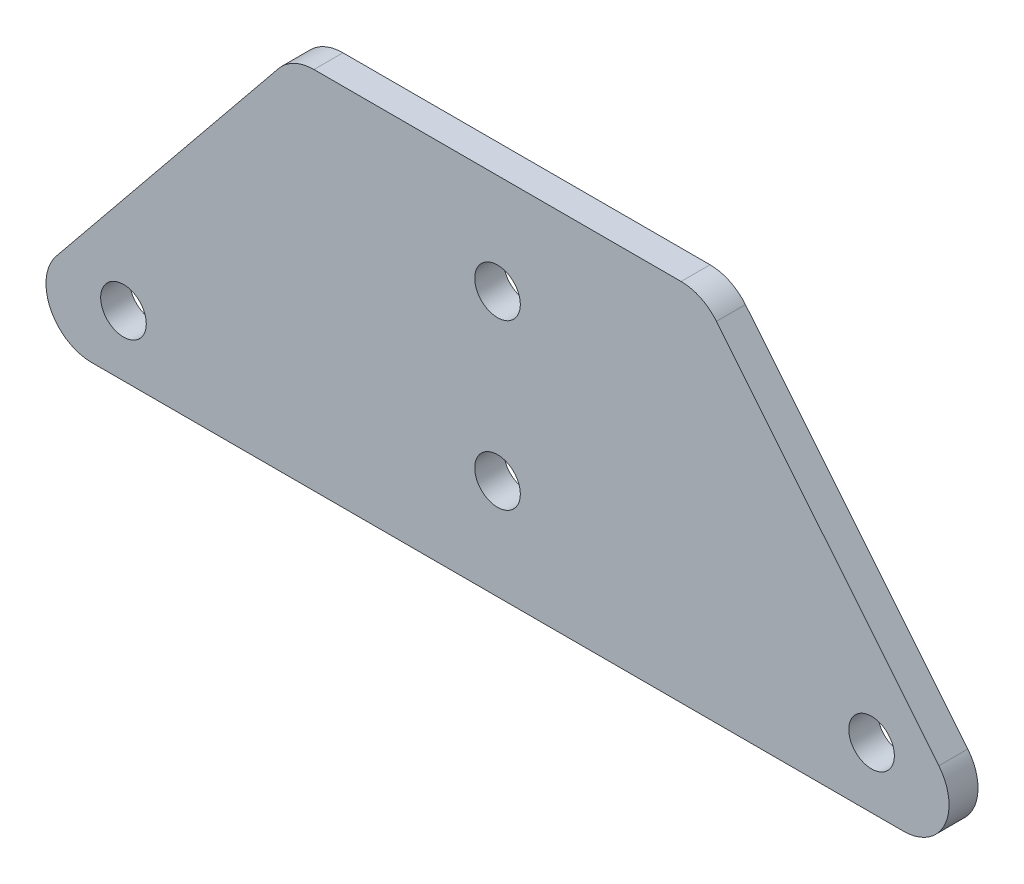
ISO-10303-21;
HEADER;
FILE_DESCRIPTION(('STEP AP214'),'2;1');
FILE_NAME('part.step','',(''),(''),'','','');
FILE_SCHEMA(('AUTOMOTIVE_DESIGN { 1 0 10303 214 1 1 1 1 }'));
ENDSEC;
DATA;
#1=APPLICATION_CONTEXT('core data for automotive mechanical design processes');
#2=APPLICATION_PROTOCOL_DEFINITION('international standard','automotive_design',2000,#1);
#3=PRODUCT_CONTEXT('',#1,'mechanical');
#4=PRODUCT('Part','Part','',(#3));
#5=PRODUCT_RELATED_PRODUCT_CATEGORY('part','',(#4));
#6=PRODUCT_DEFINITION_FORMATION('','',#4);
#7=PRODUCT_DEFINITION_CONTEXT('part definition',#1,'design');
#8=PRODUCT_DEFINITION('design','',#6,#7);
#9=PRODUCT_DEFINITION_SHAPE('','',#8);
#10=(LENGTH_UNIT() NAMED_UNIT(*) SI_UNIT(.MILLI.,.METRE.));
#11=(NAMED_UNIT(*) PLANE_ANGLE_UNIT() SI_UNIT($,.RADIAN.));
#12=(NAMED_UNIT(*) SI_UNIT($,.STERADIAN.) SOLID_ANGLE_UNIT());
#13=UNCERTAINTY_MEASURE_WITH_UNIT(LENGTH_MEASURE(1.E-05),#10,'distance_accuracy_value','');
#14=(GEOMETRIC_REPRESENTATION_CONTEXT(3) GLOBAL_UNCERTAINTY_ASSIGNED_CONTEXT((#13)) GLOBAL_UNIT_ASSIGNED_CONTEXT((#10,
#11,#12)) REPRESENTATION_CONTEXT('',''));
#15=CARTESIAN_POINT('',(0.,0.,0.));
#16=DIRECTION('',(0.,0.,1.));
#17=DIRECTION('',(1.,0.,0.));
#18=AXIS2_PLACEMENT_3D('',#15,#16,#17);
#19=CARTESIAN_POINT('',(44.4951474599724,-18.1529631254723,3.175));
#20=DIRECTION('',(0.,0.,1.));
#21=DIRECTION('',(1.,0.,0.));
#22=AXIS2_PLACEMENT_3D('',#19,#20,#21);
#23=PLANE('',#22);
#24=CARTESIAN_POINT('',(-41.,-16.4893760133951,3.175));
#25=DIRECTION('',(0.,0.,1.));
#26=DIRECTION('',(1.,0.,0.));
#27=AXIS2_PLACEMENT_3D('',#24,#25,#26);
#28=CIRCLE('',#27,2.5);
#29=CARTESIAN_POINT('',(-38.5,-16.4893760133951,3.175));
#30=VERTEX_POINT('',#29);
#31=EDGE_CURVE('E192',#30,#30,#28,.T.);
#32=ORIENTED_EDGE('',*,*,#31,.F.);
#33=EDGE_LOOP('',(#32));
#34=FACE_BOUND('',#33,.T.);
#35=CARTESIAN_POINT('',(0.,-12.1529631254723,3.175));
#36=DIRECTION('',(0.,0.,1.));
#37=DIRECTION('',(1.,0.,0.));
#38=AXIS2_PLACEMENT_3D('',#35,#36,#37);
#39=CIRCLE('',#38,2.5);
#40=CARTESIAN_POINT('',(2.50000000000001,-12.1529631254723,3.175));
#41=VERTEX_POINT('',#40);
#42=EDGE_CURVE('E138',#41,#41,#39,.T.);
#43=ORIENTED_EDGE('',*,*,#42,.F.);
#44=EDGE_LOOP('',(#43));
#45=FACE_BOUND('',#44,.T.);
#46=CARTESIAN_POINT('',(44.4951474599724,-18.1529631254723,3.175));
#47=DIRECTION('',(0.,0.,1.));
#48=DIRECTION('',(1.,0.,0.));
#49=AXIS2_PLACEMENT_3D('',#46,#47,#48);
#50=CIRCLE('',#49,5.00000000000001);
#51=CARTESIAN_POINT('',(44.4951474599724,-23.1529631254723,3.175));
#52=VERTEX_POINT('',#51);
#53=CARTESIAN_POINT('',(48.3757174605537,-15.,3.175));
#54=VERTEX_POINT('',#53);
#55=EDGE_CURVE('E149',#52,#54,#50,.T.);
#56=ORIENTED_EDGE('',*,*,#55,.T.);
#57=DIRECTION('',(-0.630592625094466,0.776114000116265,0.));
#58=VECTOR('',#57,1.);
#59=CARTESIAN_POINT('',(48.3757174605537,-15.,3.175));
#60=LINE('',#59,#58);
#61=CARTESIAN_POINT('',(24.0007174605538,15.,3.175));
#62=VERTEX_POINT('',#61);
#63=EDGE_CURVE('E97',#54,#62,#60,.T.);
#64=ORIENTED_EDGE('',*,*,#63,.T.);
#65=CARTESIAN_POINT('',(20.1201474599724,11.8470368745277,3.175));
#66=DIRECTION('',(0.,0.,1.));
#67=DIRECTION('',(1.,0.,0.));
#68=AXIS2_PLACEMENT_3D('',#65,#66,#67);
#69=CIRCLE('',#68,5.00000000000002);
#70=CARTESIAN_POINT('',(20.1201474599724,16.8470368745277,3.175));
#71=VERTEX_POINT('',#70);
#72=EDGE_CURVE('E164',#62,#71,#69,.T.);
#73=ORIENTED_EDGE('',*,*,#72,.T.);
#74=DIRECTION('',(-1.,0.,0.));
#75=VECTOR('',#74,1.);
#76=CARTESIAN_POINT('',(20.1201474599724,16.8470368745277,3.175));
#77=LINE('',#76,#75);
#78=CARTESIAN_POINT('',(-20.1201474599724,16.8470368745277,3.175));
#79=VERTEX_POINT('',#78);
#80=EDGE_CURVE('E177',#71,#79,#77,.T.);
#81=ORIENTED_EDGE('',*,*,#80,.T.);
#82=CARTESIAN_POINT('',(-20.1201474599724,11.8470368745277,3.175));
#83=DIRECTION('',(0.,0.,1.));
#84=DIRECTION('',(1.,0.,0.));
#85=AXIS2_PLACEMENT_3D('',#82,#83,#84);
#86=CIRCLE('',#85,5.00000000000002);
#87=CARTESIAN_POINT('',(-24.0007174605538,15.,3.175));
#88=VERTEX_POINT('',#87);
#89=EDGE_CURVE('E116',#79,#88,#86,.T.);
#90=ORIENTED_EDGE('',*,*,#89,.T.);
#91=DIRECTION('',(-0.630592625094466,-0.776114000116265,0.));
#92=VECTOR('',#91,1.);
#93=CARTESIAN_POINT('',(-24.0007174605538,15.,3.175));
#94=LINE('',#93,#92);
#95=CARTESIAN_POINT('',(-48.3757174605537,-15.,3.175));
#96=VERTEX_POINT('',#95);
#97=EDGE_CURVE('E110',#88,#96,#94,.T.);
#98=ORIENTED_EDGE('',*,*,#97,.T.);
#99=CARTESIAN_POINT('',(-44.4951474599724,-18.1529631254723,3.175));
#100=DIRECTION('',(0.,0.,1.));
#101=DIRECTION('',(-1.,0.,0.));
#102=AXIS2_PLACEMENT_3D('',#99,#100,#101);
#103=CIRCLE('',#102,5.00000000000001);
#104=CARTESIAN_POINT('',(-44.4951474599724,-23.1529631254723,3.175));
#105=VERTEX_POINT('',#104);
#106=EDGE_CURVE('E114',#96,#105,#103,.T.);
#107=ORIENTED_EDGE('',*,*,#106,.T.);
#108=DIRECTION('',(1.,0.,0.));
#109=VECTOR('',#108,1.);
#110=CARTESIAN_POINT('',(-44.4951474599724,-23.1529631254723,3.175));
#111=LINE('',#110,#109);
#112=EDGE_CURVE('E54',#105,#52,#111,.T.);
#113=ORIENTED_EDGE('',*,*,#112,.T.);
#114=EDGE_LOOP('',(#56,#64,#73,#81,#90,#98,#107,#113));
#115=FACE_BOUND('',#114,.T.);
#116=CARTESIAN_POINT('',(0.,5.8470368745277,3.175));
#117=DIRECTION('',(0.,0.,1.));
#118=DIRECTION('',(1.,0.,0.));
#119=AXIS2_PLACEMENT_3D('',#116,#117,#118);
#120=CIRCLE('',#119,2.5);
#121=CARTESIAN_POINT('',(2.50000000000001,5.8470368745277,3.175));
#122=VERTEX_POINT('',#121);
#123=EDGE_CURVE('E186',#122,#122,#120,.T.);
#124=ORIENTED_EDGE('',*,*,#123,.F.);
#125=EDGE_LOOP('',(#124));
#126=FACE_BOUND('',#125,.T.);
#127=CARTESIAN_POINT('',(41.,-16.4893760133951,3.175));
#128=DIRECTION('',(0.,0.,1.));
#129=DIRECTION('',(1.,0.,0.));
#130=AXIS2_PLACEMENT_3D('',#127,#128,#129);
#131=CIRCLE('',#130,2.5);
#132=CARTESIAN_POINT('',(43.5,-16.4893760133951,3.175));
#133=VERTEX_POINT('',#132);
#134=EDGE_CURVE('E198',#133,#133,#131,.T.);
#135=ORIENTED_EDGE('',*,*,#134,.F.);
#136=EDGE_LOOP('',(#135));
#137=FACE_BOUND('',#136,.T.);
#138=ADVANCED_FACE('F37',(#34,#45,#115,#126,#137),#23,.T.);
#139=CARTESIAN_POINT('',(44.4951474599724,-18.1529631254723,0.));
#140=DIRECTION('',(0.,0.,1.));
#141=DIRECTION('',(1.,0.,0.));
#142=AXIS2_PLACEMENT_3D('',#139,#140,#141);
#143=PLANE('',#142);
#144=CARTESIAN_POINT('',(44.4951474599724,-18.1529631254723,0.));
#145=DIRECTION('',(0.,0.,1.));
#146=DIRECTION('',(1.,0.,0.));
#147=AXIS2_PLACEMENT_3D('',#144,#145,#146);
#148=CIRCLE('',#147,5.00000000000001);
#149=CARTESIAN_POINT('',(44.4951474599724,-23.1529631254723,0.));
#150=VERTEX_POINT('',#149);
#151=CARTESIAN_POINT('',(48.3757174605537,-15.,0.));
#152=VERTEX_POINT('',#151);
#153=EDGE_CURVE('E134',#150,#152,#148,.T.);
#154=ORIENTED_EDGE('',*,*,#153,.F.);
#155=DIRECTION('',(1.,0.,0.));
#156=VECTOR('',#155,1.);
#157=CARTESIAN_POINT('',(-44.4951474599724,-23.1529631254723,0.));
#158=LINE('',#157,#156);
#159=CARTESIAN_POINT('',(-44.4951474599724,-23.1529631254723,0.));
#160=VERTEX_POINT('',#159);
#161=EDGE_CURVE('E89',#160,#150,#158,.T.);
#162=ORIENTED_EDGE('',*,*,#161,.F.);
#163=CARTESIAN_POINT('',(-44.4951474599724,-18.1529631254723,0.));
#164=DIRECTION('',(0.,0.,1.));
#165=DIRECTION('',(-1.,0.,0.));
#166=AXIS2_PLACEMENT_3D('',#163,#164,#165);
#167=CIRCLE('',#166,5.00000000000001);
#168=CARTESIAN_POINT('',(-48.3757174605537,-15.,0.));
#169=VERTEX_POINT('',#168);
#170=EDGE_CURVE('E83',#169,#160,#167,.T.);
#171=ORIENTED_EDGE('',*,*,#170,.F.);
#172=DIRECTION('',(-0.630592625094466,-0.776114000116265,0.));
#173=VECTOR('',#172,1.);
#174=CARTESIAN_POINT('',(-24.0007174605538,15.,0.));
#175=LINE('',#174,#173);
#176=CARTESIAN_POINT('',(-24.0007174605538,15.,0.));
#177=VERTEX_POINT('',#176);
#178=EDGE_CURVE('E124',#177,#169,#175,.T.);
#179=ORIENTED_EDGE('',*,*,#178,.F.);
#180=CARTESIAN_POINT('',(-20.1201474599724,11.8470368745277,0.));
#181=DIRECTION('',(0.,0.,1.));
#182=DIRECTION('',(1.,0.,0.));
#183=AXIS2_PLACEMENT_3D('',#180,#181,#182);
#184=CIRCLE('',#183,5.00000000000002);
#185=CARTESIAN_POINT('',(-20.1201474599724,16.8470368745277,0.));
#186=VERTEX_POINT('',#185);
#187=EDGE_CURVE('E144',#186,#177,#184,.T.);
#188=ORIENTED_EDGE('',*,*,#187,.F.);
#189=DIRECTION('',(-1.,0.,0.));
#190=VECTOR('',#189,1.);
#191=CARTESIAN_POINT('',(20.1201474599724,16.8470368745277,0.));
#192=LINE('',#191,#190);
#193=CARTESIAN_POINT('',(20.1201474599724,16.8470368745277,0.));
#194=VERTEX_POINT('',#193);
#195=EDGE_CURVE('E142',#194,#186,#192,.T.);
#196=ORIENTED_EDGE('',*,*,#195,.F.);
#197=CARTESIAN_POINT('',(20.1201474599724,11.8470368745277,0.));
#198=DIRECTION('',(0.,0.,1.));
#199=DIRECTION('',(1.,0.,0.));
#200=AXIS2_PLACEMENT_3D('',#197,#198,#199);
#201=CIRCLE('',#200,5.00000000000002);
#202=CARTESIAN_POINT('',(24.0007174605538,15.,0.));
#203=VERTEX_POINT('',#202);
#204=EDGE_CURVE('E140',#203,#194,#201,.T.);
#205=ORIENTED_EDGE('',*,*,#204,.F.);
#206=DIRECTION('',(-0.630592625094466,0.776114000116265,0.));
#207=VECTOR('',#206,1.);
#208=CARTESIAN_POINT('',(48.3757174605537,-15.,0.));
#209=LINE('',#208,#207);
#210=EDGE_CURVE('E137',#152,#203,#209,.T.);
#211=ORIENTED_EDGE('',*,*,#210,.F.);
#212=EDGE_LOOP('',(#154,#162,#171,#179,#188,#196,#205,#211));
#213=FACE_BOUND('',#212,.T.);
#214=CARTESIAN_POINT('',(0.,-12.1529631254723,0.));
#215=DIRECTION('',(0.,0.,1.));
#216=DIRECTION('',(1.,0.,0.));
#217=AXIS2_PLACEMENT_3D('',#214,#215,#216);
#218=CIRCLE('',#217,2.5);
#219=CARTESIAN_POINT('',(2.50000000000001,-12.1529631254723,0.));
#220=VERTEX_POINT('',#219);
#221=EDGE_CURVE('E183',#220,#220,#218,.T.);
#222=ORIENTED_EDGE('',*,*,#221,.T.);
#223=EDGE_LOOP('',(#222));
#224=FACE_BOUND('',#223,.T.);
#225=CARTESIAN_POINT('',(0.,5.8470368745277,0.));
#226=DIRECTION('',(0.,0.,1.));
#227=DIRECTION('',(1.,0.,0.));
#228=AXIS2_PLACEMENT_3D('',#225,#226,#227);
#229=CIRCLE('',#228,2.5);
#230=CARTESIAN_POINT('',(2.50000000000001,5.8470368745277,0.));
#231=VERTEX_POINT('',#230);
#232=EDGE_CURVE('E189',#231,#231,#229,.T.);
#233=ORIENTED_EDGE('',*,*,#232,.T.);
#234=EDGE_LOOP('',(#233));
#235=FACE_BOUND('',#234,.T.);
#236=CARTESIAN_POINT('',(-41.,-16.4893760133951,0.));
#237=DIRECTION('',(0.,0.,1.));
#238=DIRECTION('',(1.,0.,0.));
#239=AXIS2_PLACEMENT_3D('',#236,#237,#238);
#240=CIRCLE('',#239,2.5);
#241=CARTESIAN_POINT('',(-38.5,-16.4893760133951,0.));
#242=VERTEX_POINT('',#241);
#243=EDGE_CURVE('E195',#242,#242,#240,.T.);
#244=ORIENTED_EDGE('',*,*,#243,.T.);
#245=EDGE_LOOP('',(#244));
#246=FACE_BOUND('',#245,.T.);
#247=CARTESIAN_POINT('',(41.,-16.4893760133951,0.));
#248=DIRECTION('',(0.,0.,1.));
#249=DIRECTION('',(1.,0.,0.));
#250=AXIS2_PLACEMENT_3D('',#247,#248,#249);
#251=CIRCLE('',#250,2.5);
#252=CARTESIAN_POINT('',(43.5,-16.4893760133951,0.));
#253=VERTEX_POINT('',#252);
#254=EDGE_CURVE('E201',#253,#253,#251,.T.);
#255=ORIENTED_EDGE('',*,*,#254,.T.);
#256=EDGE_LOOP('',(#255));
#257=FACE_BOUND('',#256,.T.);
#258=ADVANCED_FACE('F168',(#213,#224,#235,#246,#257),#143,.F.);
#259=CARTESIAN_POINT('',(44.4951474599724,-18.1529631254723,3.175));
#260=DIRECTION('',(0.,0.,-1.));
#261=DIRECTION('',(-1.,0.,0.));
#262=AXIS2_PLACEMENT_3D('',#259,#260,#261);
#263=CYLINDRICAL_SURFACE('',#262,5.00000000000001);
#264=ORIENTED_EDGE('',*,*,#153,.T.);
#265=DIRECTION('',(0.,0.,-1.));
#266=VECTOR('',#265,1.);
#267=CARTESIAN_POINT('',(48.3757174605537,-15.,3.175));
#268=LINE('',#267,#266);
#269=EDGE_CURVE('E11',#54,#152,#268,.T.);
#270=ORIENTED_EDGE('',*,*,#269,.F.);
#271=ORIENTED_EDGE('',*,*,#55,.F.);
#272=DIRECTION('',(0.,0.,-1.));
#273=VECTOR('',#272,1.);
#274=CARTESIAN_POINT('',(44.4951474599724,-23.1529631254723,3.175));
#275=LINE('',#274,#273);
#276=EDGE_CURVE('E130',#52,#150,#275,.T.);
#277=ORIENTED_EDGE('',*,*,#276,.T.);
#278=EDGE_LOOP('',(#264,#270,#271,#277));
#279=FACE_BOUND('',#278,.T.);
#280=ADVANCED_FACE('F39',(#279),#263,.T.);
#281=CARTESIAN_POINT('',(48.3757174605537,-15.,3.175));
#282=DIRECTION('',(-0.776114000116265,-0.630592625094466,0.));
#283=DIRECTION('',(0.630592625094466,-0.776114000116266,0.));
#284=AXIS2_PLACEMENT_3D('',#281,#282,#283);
#285=PLANE('',#284);
#286=ORIENTED_EDGE('',*,*,#210,.T.);
#287=DIRECTION('',(0.,0.,-1.));
#288=VECTOR('',#287,1.);
#289=CARTESIAN_POINT('',(24.0007174605538,15.,3.175));
#290=LINE('',#289,#288);
#291=EDGE_CURVE('E46',#62,#203,#290,.T.);
#292=ORIENTED_EDGE('',*,*,#291,.F.);
#293=ORIENTED_EDGE('',*,*,#63,.F.);
#294=ORIENTED_EDGE('',*,*,#269,.T.);
#295=EDGE_LOOP('',(#286,#292,#293,#294));
#296=FACE_BOUND('',#295,.T.);
#297=ADVANCED_FACE('F235',(#296),#285,.F.);
#298=CARTESIAN_POINT('',(20.1201474599724,11.8470368745277,3.175));
#299=DIRECTION('',(0.,0.,-1.));
#300=DIRECTION('',(-1.,0.,0.));
#301=AXIS2_PLACEMENT_3D('',#298,#299,#300);
#302=CYLINDRICAL_SURFACE('',#301,5.00000000000002);
#303=ORIENTED_EDGE('',*,*,#204,.T.);
#304=DIRECTION('',(0.,0.,-1.));
#305=VECTOR('',#304,1.);
#306=CARTESIAN_POINT('',(20.1201474599724,16.8470368745277,3.175));
#307=LINE('',#306,#305);
#308=EDGE_CURVE('E156',#71,#194,#307,.T.);
#309=ORIENTED_EDGE('',*,*,#308,.F.);
#310=ORIENTED_EDGE('',*,*,#72,.F.);
#311=ORIENTED_EDGE('',*,*,#291,.T.);
#312=EDGE_LOOP('',(#303,#309,#310,#311));
#313=FACE_BOUND('',#312,.T.);
#314=ADVANCED_FACE('F162',(#313),#302,.T.);
#315=CARTESIAN_POINT('',(20.1201474599724,16.8470368745277,3.175));
#316=DIRECTION('',(0.,-1.,0.));
#317=DIRECTION('',(0.,0.,-1.));
#318=AXIS2_PLACEMENT_3D('',#315,#316,#317);
#319=PLANE('',#318);
#320=ORIENTED_EDGE('',*,*,#195,.T.);
#321=DIRECTION('',(0.,0.,-1.));
#322=VECTOR('',#321,1.);
#323=CARTESIAN_POINT('',(-20.1201474599724,16.8470368745277,3.175));
#324=LINE('',#323,#322);
#325=EDGE_CURVE('E153',#79,#186,#324,.T.);
#326=ORIENTED_EDGE('',*,*,#325,.F.);
#327=ORIENTED_EDGE('',*,*,#80,.F.);
#328=ORIENTED_EDGE('',*,*,#308,.T.);
#329=EDGE_LOOP('',(#320,#326,#327,#328));
#330=FACE_BOUND('',#329,.T.);
#331=ADVANCED_FACE('F173',(#330),#319,.F.);
#332=CARTESIAN_POINT('',(-20.1201474599724,11.8470368745277,3.175));
#333=DIRECTION('',(0.,0.,-1.));
#334=DIRECTION('',(-1.,0.,0.));
#335=AXIS2_PLACEMENT_3D('',#332,#333,#334);
#336=CYLINDRICAL_SURFACE('',#335,5.00000000000002);
#337=ORIENTED_EDGE('',*,*,#187,.T.);
#338=DIRECTION('',(0.,0.,-1.));
#339=VECTOR('',#338,1.);
#340=CARTESIAN_POINT('',(-24.0007174605538,15.,3.175));
#341=LINE('',#340,#339);
#342=EDGE_CURVE('E125',#88,#177,#341,.T.);
#343=ORIENTED_EDGE('',*,*,#342,.F.);
#344=ORIENTED_EDGE('',*,*,#89,.F.);
#345=ORIENTED_EDGE('',*,*,#325,.T.);
#346=EDGE_LOOP('',(#337,#343,#344,#345));
#347=FACE_BOUND('',#346,.T.);
#348=ADVANCED_FACE('F176',(#347),#336,.T.);
#349=CARTESIAN_POINT('',(-24.0007174605538,15.,3.175));
#350=DIRECTION('',(0.776114000116265,-0.630592625094466,0.));
#351=DIRECTION('',(0.630592625094466,0.776114000116266,0.));
#352=AXIS2_PLACEMENT_3D('',#349,#350,#351);
#353=PLANE('',#352);
#354=ORIENTED_EDGE('',*,*,#178,.T.);
#355=DIRECTION('',(0.,0.,-1.));
#356=VECTOR('',#355,1.);
#357=CARTESIAN_POINT('',(-48.3757174605537,-15.,3.175));
#358=LINE('',#357,#356);
#359=EDGE_CURVE('E121',#96,#169,#358,.T.);
#360=ORIENTED_EDGE('',*,*,#359,.F.);
#361=ORIENTED_EDGE('',*,*,#97,.F.);
#362=ORIENTED_EDGE('',*,*,#342,.T.);
#363=EDGE_LOOP('',(#354,#360,#361,#362));
#364=FACE_BOUND('',#363,.T.);
#365=ADVANCED_FACE('F122',(#364),#353,.F.);
#366=CARTESIAN_POINT('',(-44.4951474599724,-18.1529631254723,3.175));
#367=DIRECTION('',(0.,0.,-1.));
#368=DIRECTION('',(-1.,0.,0.));
#369=AXIS2_PLACEMENT_3D('',#366,#367,#368);
#370=CYLINDRICAL_SURFACE('',#369,5.00000000000001);
#371=ORIENTED_EDGE('',*,*,#170,.T.);
#372=DIRECTION('',(0.,0.,-1.));
#373=VECTOR('',#372,1.);
#374=CARTESIAN_POINT('',(-44.4951474599724,-23.1529631254723,3.175));
#375=LINE('',#374,#373);
#376=EDGE_CURVE('E126',#105,#160,#375,.T.);
#377=ORIENTED_EDGE('',*,*,#376,.F.);
#378=ORIENTED_EDGE('',*,*,#106,.F.);
#379=ORIENTED_EDGE('',*,*,#359,.T.);
#380=EDGE_LOOP('',(#371,#377,#378,#379));
#381=FACE_BOUND('',#380,.T.);
#382=ADVANCED_FACE('F128',(#381),#370,.T.);
#383=CARTESIAN_POINT('',(-44.4951474599724,-23.1529631254723,3.175));
#384=DIRECTION('',(0.,1.,0.));
#385=DIRECTION('',(-1.,0.,0.));
#386=AXIS2_PLACEMENT_3D('',#383,#384,#385);
#387=PLANE('',#386);
#388=ORIENTED_EDGE('',*,*,#161,.T.);
#389=ORIENTED_EDGE('',*,*,#276,.F.);
#390=ORIENTED_EDGE('',*,*,#112,.F.);
#391=ORIENTED_EDGE('',*,*,#376,.T.);
#392=EDGE_LOOP('',(#388,#389,#390,#391));
#393=FACE_BOUND('',#392,.T.);
#394=ADVANCED_FACE('F223',(#393),#387,.F.);
#395=CARTESIAN_POINT('',(0.,-12.1529631254723,3.175));
#396=DIRECTION('',(0.,0.,-1.));
#397=DIRECTION('',(-1.,0.,0.));
#398=AXIS2_PLACEMENT_3D('',#395,#396,#397);
#399=CYLINDRICAL_SURFACE('',#398,2.5);
#400=ORIENTED_EDGE('',*,*,#42,.T.);
#401=EDGE_LOOP('',(#400));
#402=FACE_BOUND('',#401,.T.);
#403=ORIENTED_EDGE('',*,*,#221,.F.);
#404=EDGE_LOOP('',(#403));
#405=FACE_BOUND('',#404,.T.);
#406=ADVANCED_FACE('F220',(#402,#405),#399,.F.);
#407=CARTESIAN_POINT('',(0.,5.8470368745277,3.175));
#408=DIRECTION('',(0.,0.,-1.));
#409=DIRECTION('',(-1.,0.,0.));
#410=AXIS2_PLACEMENT_3D('',#407,#408,#409);
#411=CYLINDRICAL_SURFACE('',#410,2.5);
#412=ORIENTED_EDGE('',*,*,#123,.T.);
#413=EDGE_LOOP('',(#412));
#414=FACE_BOUND('',#413,.T.);
#415=ORIENTED_EDGE('',*,*,#232,.F.);
#416=EDGE_LOOP('',(#415));
#417=FACE_BOUND('',#416,.T.);
#418=ADVANCED_FACE('F311',(#414,#417),#411,.F.);
#419=CARTESIAN_POINT('',(-41.,-16.4893760133951,3.175));
#420=DIRECTION('',(0.,0.,-1.));
#421=DIRECTION('',(-1.,0.,0.));
#422=AXIS2_PLACEMENT_3D('',#419,#420,#421);
#423=CYLINDRICAL_SURFACE('',#422,2.5);
#424=ORIENTED_EDGE('',*,*,#31,.T.);
#425=EDGE_LOOP('',(#424));
#426=FACE_BOUND('',#425,.T.);
#427=ORIENTED_EDGE('',*,*,#243,.F.);
#428=EDGE_LOOP('',(#427));
#429=FACE_BOUND('',#428,.T.);
#430=ADVANCED_FACE('F320',(#426,#429),#423,.F.);
#431=CARTESIAN_POINT('',(41.,-16.4893760133951,3.175));
#432=DIRECTION('',(0.,0.,-1.));
#433=DIRECTION('',(-1.,0.,0.));
#434=AXIS2_PLACEMENT_3D('',#431,#432,#433);
#435=CYLINDRICAL_SURFACE('',#434,2.5);
#436=ORIENTED_EDGE('',*,*,#134,.T.);
#437=EDGE_LOOP('',(#436));
#438=FACE_BOUND('',#437,.T.);
#439=ORIENTED_EDGE('',*,*,#254,.F.);
#440=EDGE_LOOP('',(#439));
#441=FACE_BOUND('',#440,.T.);
#442=ADVANCED_FACE('F207',(#438,#441),#435,.F.);
#443=CLOSED_SHELL('',(#138,#258,#280,#297,#314,#331,#348,#365,#382,#394,#406,#418,#430,#442));
#444=MANIFOLD_SOLID_BREP('B2',#443);
#445=ADVANCED_BREP_SHAPE_REPRESENTATION('',(#18,#444),#14);
#446=SHAPE_DEFINITION_REPRESENTATION(#9,#445);
ENDSEC;
END-ISO-10303-21;
